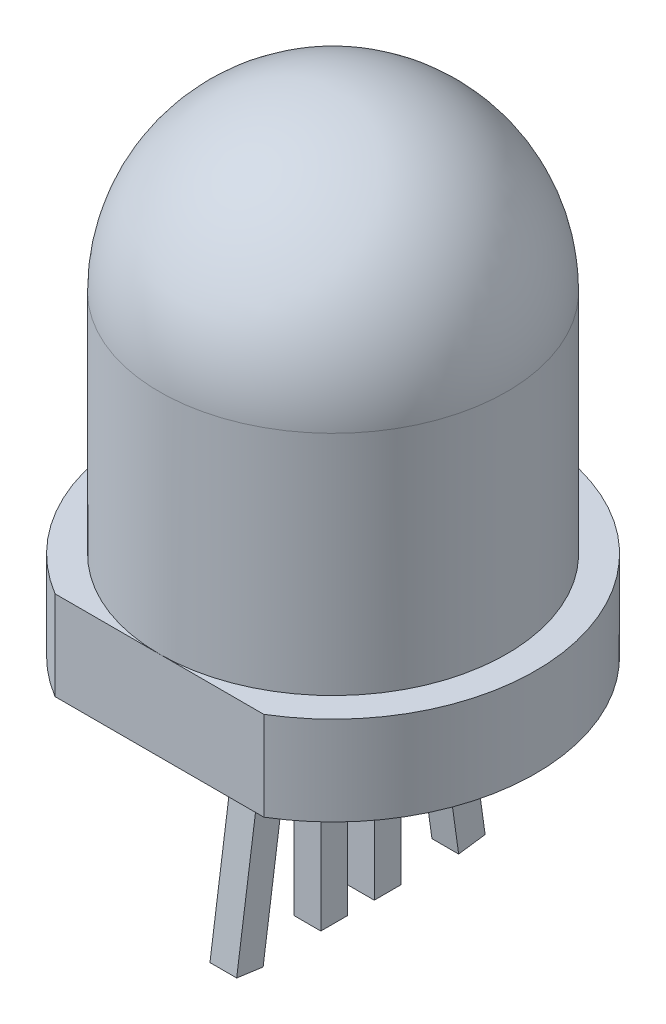
ISO-10303-21;
HEADER;
FILE_DESCRIPTION(('STEP AP214'),'2;1');
FILE_NAME('part.step','',(''),(''),'','','');
FILE_SCHEMA(('AUTOMOTIVE_DESIGN { 1 0 10303 214 1 1 1 1 }'));
ENDSEC;
DATA;
#1=APPLICATION_CONTEXT('core data for automotive mechanical design processes');
#2=APPLICATION_PROTOCOL_DEFINITION('international standard','automotive_design',2000,#1);
#3=PRODUCT_CONTEXT('',#1,'mechanical');
#4=PRODUCT('Part','Part','',(#3));
#5=PRODUCT_RELATED_PRODUCT_CATEGORY('part','',(#4));
#6=PRODUCT_DEFINITION_FORMATION('','',#4);
#7=PRODUCT_DEFINITION_CONTEXT('part definition',#1,'design');
#8=PRODUCT_DEFINITION('design','',#6,#7);
#9=PRODUCT_DEFINITION_SHAPE('','',#8);
#10=(LENGTH_UNIT() NAMED_UNIT(*) SI_UNIT(.MILLI.,.METRE.));
#11=(NAMED_UNIT(*) PLANE_ANGLE_UNIT() SI_UNIT($,.RADIAN.));
#12=(NAMED_UNIT(*) SI_UNIT($,.STERADIAN.) SOLID_ANGLE_UNIT());
#13=UNCERTAINTY_MEASURE_WITH_UNIT(LENGTH_MEASURE(1.E-05),#10,'distance_accuracy_value','');
#14=(GEOMETRIC_REPRESENTATION_CONTEXT(3) GLOBAL_UNCERTAINTY_ASSIGNED_CONTEXT((#13)) GLOBAL_UNIT_ASSIGNED_CONTEXT((#10,
#11,#12)) REPRESENTATION_CONTEXT('',''));
#15=CARTESIAN_POINT('',(0.,0.,0.));
#16=DIRECTION('',(0.,0.,1.));
#17=DIRECTION('',(1.,0.,0.));
#18=AXIS2_PLACEMENT_3D('',#15,#16,#17);
#19=CARTESIAN_POINT('',(0.,-2.,0.));
#20=DIRECTION('',(0.,-1.,0.));
#21=DIRECTION('',(0.,0.,-1.));
#22=AXIS2_PLACEMENT_3D('',#19,#20,#21);
#23=PLANE('',#22);
#24=CARTESIAN_POINT('',(0.,-2.,0.));
#25=DIRECTION('',(0.,-1.,0.));
#26=DIRECTION('',(0.,0.,-1.));
#27=AXIS2_PLACEMENT_3D('',#24,#25,#26);
#28=CIRCLE('',#27,4.55);
#29=CARTESIAN_POINT('',(-2.34360832905159,-2.,3.9));
#30=VERTEX_POINT('',#29);
#31=CARTESIAN_POINT('',(2.34360832905159,-2.,3.9));
#32=VERTEX_POINT('',#31);
#33=EDGE_CURVE('E266',#30,#32,#28,.T.);
#34=ORIENTED_EDGE('',*,*,#33,.T.);
#35=DIRECTION('',(-1.,0.,0.));
#36=VECTOR('',#35,1.);
#37=CARTESIAN_POINT('',(2.34360832905159,-2.,3.9));
#38=LINE('',#37,#36);
#39=EDGE_CURVE('E269',#32,#30,#38,.T.);
#40=ORIENTED_EDGE('',*,*,#39,.T.);
#41=EDGE_LOOP('',(#34,#40));
#42=FACE_BOUND('',#41,.T.);
#43=DIRECTION('',(1.,0.,0.));
#44=VECTOR('',#43,1.);
#45=CARTESIAN_POINT('',(-0.3,-2.,-0.0250000000000005));
#46=LINE('',#45,#44);
#47=CARTESIAN_POINT('',(-0.3,-2.,-0.0250000000000005));
#48=VERTEX_POINT('',#47);
#49=CARTESIAN_POINT('',(0.3,-2.,-0.0250000000000004));
#50=VERTEX_POINT('',#49);
#51=EDGE_CURVE('E250',#48,#50,#46,.T.);
#52=ORIENTED_EDGE('',*,*,#51,.F.);
#53=DIRECTION('',(0.,0.,-1.));
#54=VECTOR('',#53,1.);
#55=CARTESIAN_POINT('',(-0.3,-2.,-0.0250000000000005));
#56=LINE('',#55,#54);
#57=CARTESIAN_POINT('',(-0.3,-2.,0.574999999999999));
#58=VERTEX_POINT('',#57);
#59=EDGE_CURVE('E236',#58,#48,#56,.T.);
#60=ORIENTED_EDGE('',*,*,#59,.F.);
#61=DIRECTION('',(-1.,0.,0.));
#62=VECTOR('',#61,1.);
#63=CARTESIAN_POINT('',(-0.3,-2.,0.574999999999999));
#64=LINE('',#63,#62);
#65=CARTESIAN_POINT('',(0.3,-2.,0.575));
#66=VERTEX_POINT('',#65);
#67=EDGE_CURVE('E241',#66,#58,#64,.T.);
#68=ORIENTED_EDGE('',*,*,#67,.F.);
#69=DIRECTION('',(0.,0.,1.));
#70=VECTOR('',#69,1.);
#71=CARTESIAN_POINT('',(0.3,-2.,-0.0250000000000004));
#72=LINE('',#71,#70);
#73=EDGE_CURVE('E252',#50,#66,#72,.T.);
#74=ORIENTED_EDGE('',*,*,#73,.F.);
#75=EDGE_LOOP('',(#52,#60,#68,#74));
#76=FACE_BOUND('',#75,.T.);
#77=DIRECTION('',(-1.,0.,0.));
#78=VECTOR('',#77,1.);
#79=CARTESIAN_POINT('',(0.299999999999999,-2.,-0.625));
#80=LINE('',#79,#78);
#81=CARTESIAN_POINT('',(0.299999999999999,-2.,-0.625));
#82=VERTEX_POINT('',#81);
#83=CARTESIAN_POINT('',(-0.3,-2.,-0.625));
#84=VERTEX_POINT('',#83);
#85=EDGE_CURVE('E221',#82,#84,#80,.T.);
#86=ORIENTED_EDGE('',*,*,#85,.F.);
#87=DIRECTION('',(0.,0.,1.));
#88=VECTOR('',#87,1.);
#89=CARTESIAN_POINT('',(0.299999999999999,-2.,-1.225));
#90=LINE('',#89,#88);
#91=CARTESIAN_POINT('',(0.299999999999999,-2.,-1.225));
#92=VERTEX_POINT('',#91);
#93=EDGE_CURVE('E207',#92,#82,#90,.T.);
#94=ORIENTED_EDGE('',*,*,#93,.F.);
#95=DIRECTION('',(1.,0.,0.));
#96=VECTOR('',#95,1.);
#97=CARTESIAN_POINT('',(0.299999999999999,-2.,-1.225));
#98=LINE('',#97,#96);
#99=CARTESIAN_POINT('',(-0.3,-2.,-1.225));
#100=VERTEX_POINT('',#99);
#101=EDGE_CURVE('E212',#100,#92,#98,.T.);
#102=ORIENTED_EDGE('',*,*,#101,.F.);
#103=DIRECTION('',(0.,0.,-1.));
#104=VECTOR('',#103,1.);
#105=CARTESIAN_POINT('',(-0.3,-2.,-1.225));
#106=LINE('',#105,#104);
#107=EDGE_CURVE('E223',#84,#100,#106,.T.);
#108=ORIENTED_EDGE('',*,*,#107,.F.);
#109=EDGE_LOOP('',(#86,#94,#102,#108));
#110=FACE_BOUND('',#109,.T.);
#111=DIRECTION('',(1.,0.,0.));
#112=VECTOR('',#111,1.);
#113=CARTESIAN_POINT('',(0.,-2.,1.78089654351117));
#114=LINE('',#113,#112);
#115=CARTESIAN_POINT('',(-0.3,-2.,1.78089654351117));
#116=VERTEX_POINT('',#115);
#117=CARTESIAN_POINT('',(0.3,-2.,1.78089654351117));
#118=VERTEX_POINT('',#117);
#119=EDGE_CURVE('E291',#116,#118,#114,.T.);
#120=ORIENTED_EDGE('',*,*,#119,.T.);
#121=DIRECTION('',(0.,0.,-1.));
#122=VECTOR('',#121,1.);
#123=CARTESIAN_POINT('',(0.3,-2.,0.));
#124=LINE('',#123,#122);
#125=CARTESIAN_POINT('',(0.3,-2.,1.175));
#126=VERTEX_POINT('',#125);
#127=EDGE_CURVE('E294',#118,#126,#124,.T.);
#128=ORIENTED_EDGE('',*,*,#127,.T.);
#129=DIRECTION('',(1.,0.,0.));
#130=VECTOR('',#129,1.);
#131=CARTESIAN_POINT('',(0.3,-2.,1.175));
#132=LINE('',#131,#130);
#133=CARTESIAN_POINT('',(-0.3,-2.,1.175));
#134=VERTEX_POINT('',#133);
#135=EDGE_CURVE('E180',#134,#126,#132,.T.);
#136=ORIENTED_EDGE('',*,*,#135,.F.);
#137=DIRECTION('',(0.,0.,1.));
#138=VECTOR('',#137,1.);
#139=CARTESIAN_POINT('',(-0.300000000000001,-2.,0.));
#140=LINE('',#139,#138);
#141=EDGE_CURVE('E288',#134,#116,#140,.T.);
#142=ORIENTED_EDGE('',*,*,#141,.T.);
#143=EDGE_LOOP('',(#120,#128,#136,#142));
#144=FACE_BOUND('',#143,.T.);
#145=DIRECTION('',(-1.,0.,0.));
#146=VECTOR('',#145,1.);
#147=CARTESIAN_POINT('',(0.299999999999999,-2.,-1.825));
#148=LINE('',#147,#146);
#149=CARTESIAN_POINT('',(0.299999999999999,-2.,-1.82500000000001));
#150=VERTEX_POINT('',#149);
#151=CARTESIAN_POINT('',(-0.300000000000001,-2.,-1.825));
#152=VERTEX_POINT('',#151);
#153=EDGE_CURVE('E177',#150,#152,#148,.T.);
#154=ORIENTED_EDGE('',*,*,#153,.F.);
#155=DIRECTION('',(0.,0.,-1.));
#156=VECTOR('',#155,1.);
#157=CARTESIAN_POINT('',(0.299999999999999,-2.,0.));
#158=LINE('',#157,#156);
#159=CARTESIAN_POINT('',(0.299999999999999,-2.,-2.43089654351117));
#160=VERTEX_POINT('',#159);
#161=EDGE_CURVE('E11',#150,#160,#158,.T.);
#162=ORIENTED_EDGE('',*,*,#161,.T.);
#163=DIRECTION('',(-1.,0.,0.));
#164=VECTOR('',#163,1.);
#165=CARTESIAN_POINT('',(0.,-2.,-2.43089654351117));
#166=LINE('',#165,#164);
#167=CARTESIAN_POINT('',(-0.3,-2.,-2.43089654351117));
#168=VERTEX_POINT('',#167);
#169=EDGE_CURVE('E42',#160,#168,#166,.T.);
#170=ORIENTED_EDGE('',*,*,#169,.T.);
#171=DIRECTION('',(0.,0.,1.));
#172=VECTOR('',#171,1.);
#173=CARTESIAN_POINT('',(-0.300000000000001,-2.,0.));
#174=LINE('',#173,#172);
#175=EDGE_CURVE('E297',#168,#152,#174,.T.);
#176=ORIENTED_EDGE('',*,*,#175,.T.);
#177=EDGE_LOOP('',(#154,#162,#170,#176));
#178=FACE_BOUND('',#177,.T.);
#179=ADVANCED_FACE('F34',(#42,#76,#110,#144,#178),#23,.T.);
#180=CARTESIAN_POINT('',(0.,9.,0.));
#181=DIRECTION('',(0.,-1.,0.));
#182=DIRECTION('',(0.,0.,-1.));
#183=AXIS2_PLACEMENT_3D('',#180,#181,#182);
#184=CYLINDRICAL_SURFACE('',#183,3.9);
#185=CARTESIAN_POINT('',(0.,5.1,0.));
#186=DIRECTION('',(0.,-1.,0.));
#187=DIRECTION('',(0.,0.,-1.));
#188=AXIS2_PLACEMENT_3D('',#185,#186,#187);
#189=CIRCLE('',#188,3.9);
#190=CARTESIAN_POINT('',(0.,5.1,-3.9));
#191=VERTEX_POINT('',#190);
#192=EDGE_CURVE('E285',#191,#191,#189,.T.);
#193=ORIENTED_EDGE('',*,*,#192,.T.);
#194=EDGE_LOOP('',(#193));
#195=FACE_BOUND('',#194,.T.);
#196=CARTESIAN_POINT('',(0.,0.,0.));
#197=DIRECTION('',(0.,1.,0.));
#198=DIRECTION('',(0.,0.,1.));
#199=AXIS2_PLACEMENT_3D('',#196,#197,#198);
#200=CIRCLE('',#199,3.9);
#201=CARTESIAN_POINT('',(0.,0.,3.9));
#202=VERTEX_POINT('',#201);
#203=EDGE_CURVE('E282',#202,#202,#200,.T.);
#204=ORIENTED_EDGE('',*,*,#203,.T.);
#205=EDGE_LOOP('',(#204));
#206=FACE_BOUND('',#205,.T.);
#207=ADVANCED_FACE('F318',(#195,#206),#184,.T.);
#208=CARTESIAN_POINT('',(0.,5.1,0.));
#209=DIRECTION('',(0.,0.,1.));
#210=DIRECTION('',(1.,0.,0.));
#211=AXIS2_PLACEMENT_3D('',#208,#209,#210);
#212=SPHERICAL_SURFACE('',#211,3.9);
#213=CARTESIAN_POINT('',(0.,5.1,0.));
#214=DIRECTION('',(0.,-1.,0.));
#215=DIRECTION('',(0.,0.,-1.));
#216=AXIS2_PLACEMENT_3D('',#213,#214,#215);
#217=SPHERICAL_SURFACE('',#216,3.9);
#218=ORIENTED_EDGE('',*,*,#192,.F.);
#219=EDGE_LOOP('',(#218));
#220=FACE_BOUND('',#219,.T.);
#221=ADVANCED_FACE('F36',(#220),#217,.T.);
#222=CARTESIAN_POINT('',(0.,-2.,0.));
#223=DIRECTION('',(0.,1.,0.));
#224=DIRECTION('',(0.,0.,1.));
#225=AXIS2_PLACEMENT_3D('',#222,#223,#224);
#226=CYLINDRICAL_SURFACE('',#225,4.55);
#227=CARTESIAN_POINT('',(0.,0.,0.));
#228=DIRECTION('',(0.,-1.,0.));
#229=DIRECTION('',(0.,0.,-1.));
#230=AXIS2_PLACEMENT_3D('',#227,#228,#229);
#231=CIRCLE('',#230,4.55);
#232=CARTESIAN_POINT('',(-2.34360832905159,0.,3.9));
#233=VERTEX_POINT('',#232);
#234=CARTESIAN_POINT('',(2.34360832905159,0.,3.9));
#235=VERTEX_POINT('',#234);
#236=EDGE_CURVE('E265',#233,#235,#231,.T.);
#237=ORIENTED_EDGE('',*,*,#236,.T.);
#238=DIRECTION('',(0.,1.,0.));
#239=VECTOR('',#238,1.);
#240=CARTESIAN_POINT('',(2.34360832905159,-2.,3.9));
#241=LINE('',#240,#239);
#242=EDGE_CURVE('E279',#32,#235,#241,.T.);
#243=ORIENTED_EDGE('',*,*,#242,.F.);
#244=ORIENTED_EDGE('',*,*,#33,.F.);
#245=DIRECTION('',(0.,1.,0.));
#246=VECTOR('',#245,1.);
#247=CARTESIAN_POINT('',(-2.34360832905159,-2.,3.9));
#248=LINE('',#247,#246);
#249=EDGE_CURVE('E272',#30,#233,#248,.T.);
#250=ORIENTED_EDGE('',*,*,#249,.T.);
#251=EDGE_LOOP('',(#237,#243,#244,#250));
#252=FACE_BOUND('',#251,.T.);
#253=ADVANCED_FACE('F337',(#252),#226,.T.);
#254=CARTESIAN_POINT('',(2.34360832905159,-2.,3.9));
#255=DIRECTION('',(0.,0.,-1.));
#256=DIRECTION('',(-1.,0.,0.));
#257=AXIS2_PLACEMENT_3D('',#254,#255,#256);
#258=PLANE('',#257);
#259=DIRECTION('',(-1.,0.,0.));
#260=VECTOR('',#259,1.);
#261=CARTESIAN_POINT('',(2.34360832905159,0.,3.9));
#262=LINE('',#261,#260);
#263=EDGE_CURVE('E270',#235,#202,#262,.T.);
#264=ORIENTED_EDGE('',*,*,#263,.T.);
#265=EDGE_CURVE('E275',#202,#233,#262,.T.);
#266=ORIENTED_EDGE('',*,*,#265,.T.);
#267=ORIENTED_EDGE('',*,*,#249,.F.);
#268=ORIENTED_EDGE('',*,*,#39,.F.);
#269=ORIENTED_EDGE('',*,*,#242,.T.);
#270=EDGE_LOOP('',(#264,#266,#267,#268,#269));
#271=FACE_BOUND('',#270,.T.);
#272=ADVANCED_FACE('F333',(#271),#258,.F.);
#273=CARTESIAN_POINT('',(0.,0.,0.));
#274=DIRECTION('',(0.,-1.,0.));
#275=DIRECTION('',(0.,0.,-1.));
#276=AXIS2_PLACEMENT_3D('',#273,#274,#275);
#277=PLANE('',#276);
#278=ORIENTED_EDGE('',*,*,#265,.F.);
#279=ORIENTED_EDGE('',*,*,#203,.F.);
#280=ORIENTED_EDGE('',*,*,#263,.F.);
#281=ORIENTED_EDGE('',*,*,#236,.F.);
#282=EDGE_LOOP('',(#278,#279,#280,#281));
#283=FACE_BOUND('',#282,.T.);
#284=ADVANCED_FACE('F330',(#283),#277,.F.);
#285=CARTESIAN_POINT('',(-0.3,-6.9,-0.0250000000000005));
#286=DIRECTION('',(1.,0.,0.));
#287=DIRECTION('',(0.,0.,-1.));
#288=AXIS2_PLACEMENT_3D('',#285,#286,#287);
#289=PLANE('',#288);
#290=ORIENTED_EDGE('',*,*,#59,.T.);
#291=DIRECTION('',(0.,1.,0.));
#292=VECTOR('',#291,1.);
#293=CARTESIAN_POINT('',(-0.3,-6.9,-0.0250000000000005));
#294=LINE('',#293,#292);
#295=CARTESIAN_POINT('',(-0.3,-6.9,-0.0250000000000005));
#296=VERTEX_POINT('',#295);
#297=EDGE_CURVE('E263',#296,#48,#294,.T.);
#298=ORIENTED_EDGE('',*,*,#297,.F.);
#299=DIRECTION('',(0.,0.,-1.));
#300=VECTOR('',#299,1.);
#301=CARTESIAN_POINT('',(-0.3,-6.9,-0.0250000000000005));
#302=LINE('',#301,#300);
#303=CARTESIAN_POINT('',(-0.3,-6.9,0.574999999999999));
#304=VERTEX_POINT('',#303);
#305=EDGE_CURVE('E237',#304,#296,#302,.T.);
#306=ORIENTED_EDGE('',*,*,#305,.F.);
#307=DIRECTION('',(0.,1.,0.));
#308=VECTOR('',#307,1.);
#309=CARTESIAN_POINT('',(-0.3,-6.9,0.574999999999999));
#310=LINE('',#309,#308);
#311=EDGE_CURVE('E247',#304,#58,#310,.T.);
#312=ORIENTED_EDGE('',*,*,#311,.T.);
#313=EDGE_LOOP('',(#290,#298,#306,#312));
#314=FACE_BOUND('',#313,.T.);
#315=ADVANCED_FACE('F328',(#314),#289,.F.);
#316=CARTESIAN_POINT('',(-0.3,-6.9,-0.0250000000000005));
#317=DIRECTION('',(0.,0.,1.));
#318=DIRECTION('',(1.,0.,0.));
#319=AXIS2_PLACEMENT_3D('',#316,#317,#318);
#320=PLANE('',#319);
#321=ORIENTED_EDGE('',*,*,#51,.T.);
#322=DIRECTION('',(0.,1.,0.));
#323=VECTOR('',#322,1.);
#324=CARTESIAN_POINT('',(0.3,-6.9,-0.0250000000000004));
#325=LINE('',#324,#323);
#326=CARTESIAN_POINT('',(0.3,-6.9,-0.0250000000000004));
#327=VERTEX_POINT('',#326);
#328=EDGE_CURVE('E260',#327,#50,#325,.T.);
#329=ORIENTED_EDGE('',*,*,#328,.F.);
#330=DIRECTION('',(1.,0.,0.));
#331=VECTOR('',#330,1.);
#332=CARTESIAN_POINT('',(-0.3,-6.9,-0.0250000000000005));
#333=LINE('',#332,#331);
#334=EDGE_CURVE('E240',#296,#327,#333,.T.);
#335=ORIENTED_EDGE('',*,*,#334,.F.);
#336=ORIENTED_EDGE('',*,*,#297,.T.);
#337=EDGE_LOOP('',(#321,#329,#335,#336));
#338=FACE_BOUND('',#337,.T.);
#339=ADVANCED_FACE('F392',(#338),#320,.F.);
#340=CARTESIAN_POINT('',(0.3,-6.9,-0.0250000000000004));
#341=DIRECTION('',(-1.,0.,0.));
#342=DIRECTION('',(0.,0.,1.));
#343=AXIS2_PLACEMENT_3D('',#340,#341,#342);
#344=PLANE('',#343);
#345=ORIENTED_EDGE('',*,*,#73,.T.);
#346=DIRECTION('',(0.,1.,0.));
#347=VECTOR('',#346,1.);
#348=CARTESIAN_POINT('',(0.3,-6.9,0.575));
#349=LINE('',#348,#347);
#350=CARTESIAN_POINT('',(0.3,-6.9,0.575));
#351=VERTEX_POINT('',#350);
#352=EDGE_CURVE('E258',#351,#66,#349,.T.);
#353=ORIENTED_EDGE('',*,*,#352,.F.);
#354=DIRECTION('',(0.,0.,1.));
#355=VECTOR('',#354,1.);
#356=CARTESIAN_POINT('',(0.3,-6.9,-0.0250000000000004));
#357=LINE('',#356,#355);
#358=EDGE_CURVE('E243',#327,#351,#357,.T.);
#359=ORIENTED_EDGE('',*,*,#358,.F.);
#360=ORIENTED_EDGE('',*,*,#328,.T.);
#361=EDGE_LOOP('',(#345,#353,#359,#360));
#362=FACE_BOUND('',#361,.T.);
#363=ADVANCED_FACE('F401',(#362),#344,.F.);
#364=CARTESIAN_POINT('',(-0.3,-6.9,0.574999999999999));
#365=DIRECTION('',(0.,0.,-1.));
#366=DIRECTION('',(-1.,0.,0.));
#367=AXIS2_PLACEMENT_3D('',#364,#365,#366);
#368=PLANE('',#367);
#369=ORIENTED_EDGE('',*,*,#67,.T.);
#370=ORIENTED_EDGE('',*,*,#311,.F.);
#371=DIRECTION('',(-1.,0.,0.));
#372=VECTOR('',#371,1.);
#373=CARTESIAN_POINT('',(-0.3,-6.9,0.574999999999999));
#374=LINE('',#373,#372);
#375=EDGE_CURVE('E245',#351,#304,#374,.T.);
#376=ORIENTED_EDGE('',*,*,#375,.F.);
#377=ORIENTED_EDGE('',*,*,#352,.T.);
#378=EDGE_LOOP('',(#369,#370,#376,#377));
#379=FACE_BOUND('',#378,.T.);
#380=ADVANCED_FACE('F410',(#379),#368,.F.);
#381=CARTESIAN_POINT('',(0.,-6.9,0.));
#382=DIRECTION('',(0.,1.,0.));
#383=DIRECTION('',(0.,0.,1.));
#384=AXIS2_PLACEMENT_3D('',#381,#382,#383);
#385=PLANE('',#384);
#386=ORIENTED_EDGE('',*,*,#305,.T.);
#387=ORIENTED_EDGE('',*,*,#334,.T.);
#388=ORIENTED_EDGE('',*,*,#358,.T.);
#389=ORIENTED_EDGE('',*,*,#375,.T.);
#390=EDGE_LOOP('',(#386,#387,#388,#389));
#391=FACE_BOUND('',#390,.T.);
#392=ADVANCED_FACE('F420',(#391),#385,.F.);
#393=CARTESIAN_POINT('',(0.299999999999999,-6.9,-1.225));
#394=DIRECTION('',(-1.,0.,0.));
#395=DIRECTION('',(0.,0.,1.));
#396=AXIS2_PLACEMENT_3D('',#393,#394,#395);
#397=PLANE('',#396);
#398=ORIENTED_EDGE('',*,*,#93,.T.);
#399=DIRECTION('',(0.,1.,0.));
#400=VECTOR('',#399,1.);
#401=CARTESIAN_POINT('',(0.299999999999999,-6.9,-0.625));
#402=LINE('',#401,#400);
#403=CARTESIAN_POINT('',(0.299999999999999,-6.9,-0.625));
#404=VERTEX_POINT('',#403);
#405=EDGE_CURVE('E234',#404,#82,#402,.T.);
#406=ORIENTED_EDGE('',*,*,#405,.F.);
#407=DIRECTION('',(0.,0.,1.));
#408=VECTOR('',#407,1.);
#409=CARTESIAN_POINT('',(0.299999999999999,-6.9,-1.225));
#410=LINE('',#409,#408);
#411=CARTESIAN_POINT('',(0.299999999999999,-6.9,-1.225));
#412=VERTEX_POINT('',#411);
#413=EDGE_CURVE('E208',#412,#404,#410,.T.);
#414=ORIENTED_EDGE('',*,*,#413,.F.);
#415=DIRECTION('',(0.,1.,0.));
#416=VECTOR('',#415,1.);
#417=CARTESIAN_POINT('',(0.299999999999999,-6.9,-1.225));
#418=LINE('',#417,#416);
#419=EDGE_CURVE('E218',#412,#92,#418,.T.);
#420=ORIENTED_EDGE('',*,*,#419,.T.);
#421=EDGE_LOOP('',(#398,#406,#414,#420));
#422=FACE_BOUND('',#421,.T.);
#423=ADVANCED_FACE('F430',(#422),#397,.F.);
#424=CARTESIAN_POINT('',(0.299999999999999,-6.9,-0.625));
#425=DIRECTION('',(0.,0.,-1.));
#426=DIRECTION('',(-1.,0.,0.));
#427=AXIS2_PLACEMENT_3D('',#424,#425,#426);
#428=PLANE('',#427);
#429=ORIENTED_EDGE('',*,*,#85,.T.);
#430=DIRECTION('',(0.,1.,0.));
#431=VECTOR('',#430,1.);
#432=CARTESIAN_POINT('',(-0.3,-6.9,-0.625));
#433=LINE('',#432,#431);
#434=CARTESIAN_POINT('',(-0.3,-6.9,-0.625));
#435=VERTEX_POINT('',#434);
#436=EDGE_CURVE('E231',#435,#84,#433,.T.);
#437=ORIENTED_EDGE('',*,*,#436,.F.);
#438=DIRECTION('',(-1.,0.,0.));
#439=VECTOR('',#438,1.);
#440=CARTESIAN_POINT('',(0.299999999999999,-6.9,-0.625));
#441=LINE('',#440,#439);
#442=EDGE_CURVE('E211',#404,#435,#441,.T.);
#443=ORIENTED_EDGE('',*,*,#442,.F.);
#444=ORIENTED_EDGE('',*,*,#405,.T.);
#445=EDGE_LOOP('',(#429,#437,#443,#444));
#446=FACE_BOUND('',#445,.T.);
#447=ADVANCED_FACE('F440',(#446),#428,.F.);
#448=CARTESIAN_POINT('',(-0.3,-6.9,-1.225));
#449=DIRECTION('',(1.,0.,0.));
#450=DIRECTION('',(0.,0.,-1.));
#451=AXIS2_PLACEMENT_3D('',#448,#449,#450);
#452=PLANE('',#451);
#453=ORIENTED_EDGE('',*,*,#107,.T.);
#454=DIRECTION('',(0.,1.,0.));
#455=VECTOR('',#454,1.);
#456=CARTESIAN_POINT('',(-0.3,-6.9,-1.225));
#457=LINE('',#456,#455);
#458=CARTESIAN_POINT('',(-0.3,-6.9,-1.225));
#459=VERTEX_POINT('',#458);
#460=EDGE_CURVE('E229',#459,#100,#457,.T.);
#461=ORIENTED_EDGE('',*,*,#460,.F.);
#462=DIRECTION('',(0.,0.,-1.));
#463=VECTOR('',#462,1.);
#464=CARTESIAN_POINT('',(-0.3,-6.9,-1.225));
#465=LINE('',#464,#463);
#466=EDGE_CURVE('E214',#435,#459,#465,.T.);
#467=ORIENTED_EDGE('',*,*,#466,.F.);
#468=ORIENTED_EDGE('',*,*,#436,.T.);
#469=EDGE_LOOP('',(#453,#461,#467,#468));
#470=FACE_BOUND('',#469,.T.);
#471=ADVANCED_FACE('F450',(#470),#452,.F.);
#472=CARTESIAN_POINT('',(0.299999999999999,-6.9,-1.225));
#473=DIRECTION('',(0.,0.,1.));
#474=DIRECTION('',(1.,0.,0.));
#475=AXIS2_PLACEMENT_3D('',#472,#473,#474);
#476=PLANE('',#475);
#477=ORIENTED_EDGE('',*,*,#101,.T.);
#478=ORIENTED_EDGE('',*,*,#419,.F.);
#479=DIRECTION('',(1.,0.,0.));
#480=VECTOR('',#479,1.);
#481=CARTESIAN_POINT('',(0.299999999999999,-6.9,-1.225));
#482=LINE('',#481,#480);
#483=EDGE_CURVE('E216',#459,#412,#482,.T.);
#484=ORIENTED_EDGE('',*,*,#483,.F.);
#485=ORIENTED_EDGE('',*,*,#460,.T.);
#486=EDGE_LOOP('',(#477,#478,#484,#485));
#487=FACE_BOUND('',#486,.T.);
#488=ADVANCED_FACE('F460',(#487),#476,.F.);
#489=CARTESIAN_POINT('',(0.,-6.9,0.));
#490=DIRECTION('',(0.,-1.,0.));
#491=DIRECTION('',(0.,0.,-1.));
#492=AXIS2_PLACEMENT_3D('',#489,#490,#491);
#493=PLANE('',#492);
#494=ORIENTED_EDGE('',*,*,#413,.T.);
#495=ORIENTED_EDGE('',*,*,#442,.T.);
#496=ORIENTED_EDGE('',*,*,#466,.T.);
#497=ORIENTED_EDGE('',*,*,#483,.T.);
#498=EDGE_LOOP('',(#494,#495,#496,#497));
#499=FACE_BOUND('',#498,.T.);
#500=ADVANCED_FACE('F470',(#499),#493,.T.);
#501=CARTESIAN_POINT('',(0.3,-6.95134034370785,1.87086550480033));
#502=DIRECTION('',(-1.,0.,0.));
#503=DIRECTION('',(0.,0.,1.));
#504=AXIS2_PLACEMENT_3D('',#501,#502,#503);
#505=PLANE('',#504);
#506=ORIENTED_EDGE('',*,*,#127,.F.);
#507=DIRECTION('',(0.,0.99026806874157,-0.139173100960066));
#508=VECTOR('',#507,1.);
#509=CARTESIAN_POINT('',(0.3,-6.86783648313181,2.46502634604527));
#510=LINE('',#509,#508);
#511=CARTESIAN_POINT('',(0.3,-6.86783648313181,2.46502634604527));
#512=VERTEX_POINT('',#511);
#513=EDGE_CURVE('E204',#512,#118,#510,.T.);
#514=ORIENTED_EDGE('',*,*,#513,.F.);
#515=DIRECTION('',(0.,0.139173100960065,0.99026806874157));
#516=VECTOR('',#515,1.);
#517=CARTESIAN_POINT('',(0.3,-6.95134034370785,1.87086550480033));
#518=LINE('',#517,#516);
#519=CARTESIAN_POINT('',(0.3,-6.95134034370785,1.87086550480033));
#520=VERTEX_POINT('',#519);
#521=EDGE_CURVE('E182',#520,#512,#518,.T.);
#522=ORIENTED_EDGE('',*,*,#521,.F.);
#523=DIRECTION('',(0.,0.99026806874157,-0.139173100960066));
#524=VECTOR('',#523,1.);
#525=CARTESIAN_POINT('',(0.3,-6.95134034370785,1.87086550480033));
#526=LINE('',#525,#524);
#527=EDGE_CURVE('E195',#520,#126,#526,.T.);
#528=ORIENTED_EDGE('',*,*,#527,.T.);
#529=EDGE_LOOP('',(#506,#514,#522,#528));
#530=FACE_BOUND('',#529,.T.);
#531=ADVANCED_FACE('F480',(#530),#505,.F.);
#532=CARTESIAN_POINT('',(0.3,-6.86783648313181,2.46502634604527));
#533=DIRECTION('',(0.,-0.139173100960066,-0.99026806874157));
#534=DIRECTION('',(0.,0.99026806874157,-0.139173100960066));
#535=AXIS2_PLACEMENT_3D('',#532,#533,#534);
#536=PLANE('',#535);
#537=ORIENTED_EDGE('',*,*,#119,.F.);
#538=DIRECTION('',(0.,0.99026806874157,-0.139173100960066));
#539=VECTOR('',#538,1.);
#540=CARTESIAN_POINT('',(-0.3,-6.86783648313181,2.46502634604527));
#541=LINE('',#540,#539);
#542=CARTESIAN_POINT('',(-0.3,-6.86783648313181,2.46502634604527));
#543=VERTEX_POINT('',#542);
#544=EDGE_CURVE('E201',#543,#116,#541,.T.);
#545=ORIENTED_EDGE('',*,*,#544,.F.);
#546=DIRECTION('',(-1.,0.,0.));
#547=VECTOR('',#546,1.);
#548=CARTESIAN_POINT('',(0.3,-6.86783648313181,2.46502634604527));
#549=LINE('',#548,#547);
#550=EDGE_CURVE('E190',#512,#543,#549,.T.);
#551=ORIENTED_EDGE('',*,*,#550,.F.);
#552=ORIENTED_EDGE('',*,*,#513,.T.);
#553=EDGE_LOOP('',(#537,#545,#551,#552));
#554=FACE_BOUND('',#553,.T.);
#555=ADVANCED_FACE('F490',(#554),#536,.F.);
#556=CARTESIAN_POINT('',(-0.3,-6.95134034370785,1.87086550480033));
#557=DIRECTION('',(1.,0.,0.));
#558=DIRECTION('',(0.,0.,-1.));
#559=AXIS2_PLACEMENT_3D('',#556,#557,#558);
#560=PLANE('',#559);
#561=ORIENTED_EDGE('',*,*,#141,.F.);
#562=DIRECTION('',(0.,0.99026806874157,-0.139173100960066));
#563=VECTOR('',#562,1.);
#564=CARTESIAN_POINT('',(-0.3,-6.95134034370785,1.87086550480033));
#565=LINE('',#564,#563);
#566=CARTESIAN_POINT('',(-0.3,-6.95134034370785,1.87086550480033));
#567=VERTEX_POINT('',#566);
#568=EDGE_CURVE('E199',#567,#134,#565,.T.);
#569=ORIENTED_EDGE('',*,*,#568,.F.);
#570=DIRECTION('',(0.,-0.139173100960065,-0.99026806874157));
#571=VECTOR('',#570,1.);
#572=CARTESIAN_POINT('',(-0.3,-6.95134034370785,1.87086550480033));
#573=LINE('',#572,#571);
#574=EDGE_CURVE('E192',#543,#567,#573,.T.);
#575=ORIENTED_EDGE('',*,*,#574,.F.);
#576=ORIENTED_EDGE('',*,*,#544,.T.);
#577=EDGE_LOOP('',(#561,#569,#575,#576));
#578=FACE_BOUND('',#577,.T.);
#579=ADVANCED_FACE('F500',(#578),#560,.F.);
#580=CARTESIAN_POINT('',(0.3,-6.95134034370785,1.87086550480033));
#581=DIRECTION('',(0.,0.139173100960066,0.99026806874157));
#582=DIRECTION('',(0.,-0.99026806874157,0.139173100960066));
#583=AXIS2_PLACEMENT_3D('',#580,#581,#582);
#584=PLANE('',#583);
#585=ORIENTED_EDGE('',*,*,#135,.T.);
#586=ORIENTED_EDGE('',*,*,#527,.F.);
#587=DIRECTION('',(1.,0.,0.));
#588=VECTOR('',#587,1.);
#589=CARTESIAN_POINT('',(0.3,-6.95134034370785,1.87086550480033));
#590=LINE('',#589,#588);
#591=EDGE_CURVE('E194',#567,#520,#590,.T.);
#592=ORIENTED_EDGE('',*,*,#591,.F.);
#593=ORIENTED_EDGE('',*,*,#568,.T.);
#594=EDGE_LOOP('',(#585,#586,#592,#593));
#595=FACE_BOUND('',#594,.T.);
#596=ADVANCED_FACE('F510',(#595),#584,.F.);
#597=CARTESIAN_POINT('',(0.,-7.07453898618866,0.994261614253566));
#598=DIRECTION('',(0.,-0.99026806874157,0.139173100960065));
#599=DIRECTION('',(0.,-0.139173100960065,-0.99026806874157));
#600=AXIS2_PLACEMENT_3D('',#597,#598,#599);
#601=PLANE('',#600);
#602=ORIENTED_EDGE('',*,*,#521,.T.);
#603=ORIENTED_EDGE('',*,*,#550,.T.);
#604=ORIENTED_EDGE('',*,*,#574,.T.);
#605=ORIENTED_EDGE('',*,*,#591,.T.);
#606=EDGE_LOOP('',(#602,#603,#604,#605));
#607=FACE_BOUND('',#606,.T.);
#608=ADVANCED_FACE('F520',(#607),#601,.T.);
#609=CARTESIAN_POINT('',(0.299999999999999,-6.95134034370785,-2.52086550480033));
#610=DIRECTION('',(-1.,0.,0.));
#611=DIRECTION('',(0.,0.,1.));
#612=AXIS2_PLACEMENT_3D('',#609,#610,#611);
#613=PLANE('',#612);
#614=ORIENTED_EDGE('',*,*,#161,.F.);
#615=DIRECTION('',(0.,0.99026806874157,0.139173100960066));
#616=VECTOR('',#615,1.);
#617=CARTESIAN_POINT('',(0.299999999999999,-6.95134034370785,-2.52086550480033));
#618=LINE('',#617,#616);
#619=CARTESIAN_POINT('',(0.299999999999999,-6.95134034370785,-2.52086550480033));
#620=VERTEX_POINT('',#619);
#621=EDGE_CURVE('E162',#620,#150,#618,.T.);
#622=ORIENTED_EDGE('',*,*,#621,.F.);
#623=DIRECTION('',(0.,-0.139173100960066,0.99026806874157));
#624=VECTOR('',#623,1.);
#625=CARTESIAN_POINT('',(0.299999999999999,-6.95134034370785,-2.52086550480033));
#626=LINE('',#625,#624);
#627=CARTESIAN_POINT('',(0.299999999999999,-6.86783648313181,-3.11502634604527));
#628=VERTEX_POINT('',#627);
#629=EDGE_CURVE('E168',#628,#620,#626,.T.);
#630=ORIENTED_EDGE('',*,*,#629,.F.);
#631=DIRECTION('',(0.,0.99026806874157,0.139173100960066));
#632=VECTOR('',#631,1.);
#633=CARTESIAN_POINT('',(0.299999999999999,-6.86783648313181,-3.11502634604527));
#634=LINE('',#633,#632);
#635=EDGE_CURVE('E304',#628,#160,#634,.T.);
#636=ORIENTED_EDGE('',*,*,#635,.T.);
#637=EDGE_LOOP('',(#614,#622,#630,#636));
#638=FACE_BOUND('',#637,.T.);
#639=ADVANCED_FACE('F179',(#638),#613,.F.);
#640=CARTESIAN_POINT('',(0.299999999999999,-6.95134034370785,-2.52086550480033));
#641=DIRECTION('',(0.,0.139173100960066,-0.99026806874157));
#642=DIRECTION('',(0.,0.99026806874157,0.139173100960066));
#643=AXIS2_PLACEMENT_3D('',#640,#641,#642);
#644=PLANE('',#643);
#645=ORIENTED_EDGE('',*,*,#153,.T.);
#646=DIRECTION('',(0.,0.99026806874157,0.139173100960066));
#647=VECTOR('',#646,1.);
#648=CARTESIAN_POINT('',(-0.300000000000001,-6.95134034370785,-2.52086550480033));
#649=LINE('',#648,#647);
#650=CARTESIAN_POINT('',(-0.300000000000001,-6.95134034370785,-2.52086550480033));
#651=VERTEX_POINT('',#650);
#652=EDGE_CURVE('E164',#651,#152,#649,.T.);
#653=ORIENTED_EDGE('',*,*,#652,.F.);
#654=DIRECTION('',(-1.,0.,0.));
#655=VECTOR('',#654,1.);
#656=CARTESIAN_POINT('',(0.299999999999999,-6.95134034370785,-2.52086550480033));
#657=LINE('',#656,#655);
#658=EDGE_CURVE('E157',#620,#651,#657,.T.);
#659=ORIENTED_EDGE('',*,*,#658,.F.);
#660=ORIENTED_EDGE('',*,*,#621,.T.);
#661=EDGE_LOOP('',(#645,#653,#659,#660));
#662=FACE_BOUND('',#661,.T.);
#663=ADVANCED_FACE('F160',(#662),#644,.F.);
#664=CARTESIAN_POINT('',(-0.300000000000001,-6.95134034370785,-2.52086550480033));
#665=DIRECTION('',(1.,0.,0.));
#666=DIRECTION('',(0.,0.,-1.));
#667=AXIS2_PLACEMENT_3D('',#664,#665,#666);
#668=PLANE('',#667);
#669=ORIENTED_EDGE('',*,*,#175,.F.);
#670=DIRECTION('',(0.,0.99026806874157,0.139173100960066));
#671=VECTOR('',#670,1.);
#672=CARTESIAN_POINT('',(-0.3,-6.86783648313181,-3.11502634604527));
#673=LINE('',#672,#671);
#674=CARTESIAN_POINT('',(-0.3,-6.86783648313181,-3.11502634604527));
#675=VERTEX_POINT('',#674);
#676=EDGE_CURVE('E184',#675,#168,#673,.T.);
#677=ORIENTED_EDGE('',*,*,#676,.F.);
#678=DIRECTION('',(0.,0.139173100960066,-0.99026806874157));
#679=VECTOR('',#678,1.);
#680=CARTESIAN_POINT('',(-0.300000000000001,-6.95134034370785,-2.52086550480033));
#681=LINE('',#680,#679);
#682=EDGE_CURVE('E167',#651,#675,#681,.T.);
#683=ORIENTED_EDGE('',*,*,#682,.F.);
#684=ORIENTED_EDGE('',*,*,#652,.T.);
#685=EDGE_LOOP('',(#669,#677,#683,#684));
#686=FACE_BOUND('',#685,.T.);
#687=ADVANCED_FACE('F302',(#686),#668,.F.);
#688=CARTESIAN_POINT('',(0.299999999999999,-6.86783648313181,-3.11502634604527));
#689=DIRECTION('',(0.,-0.139173100960066,0.99026806874157));
#690=DIRECTION('',(0.,-0.99026806874157,-0.139173100960066));
#691=AXIS2_PLACEMENT_3D('',#688,#689,#690);
#692=PLANE('',#691);
#693=ORIENTED_EDGE('',*,*,#169,.F.);
#694=ORIENTED_EDGE('',*,*,#635,.F.);
#695=DIRECTION('',(1.,0.,0.));
#696=VECTOR('',#695,1.);
#697=CARTESIAN_POINT('',(0.299999999999999,-6.86783648313181,-3.11502634604527));
#698=LINE('',#697,#696);
#699=EDGE_CURVE('E173',#675,#628,#698,.T.);
#700=ORIENTED_EDGE('',*,*,#699,.F.);
#701=ORIENTED_EDGE('',*,*,#676,.T.);
#702=EDGE_LOOP('',(#693,#694,#700,#701));
#703=FACE_BOUND('',#702,.T.);
#704=ADVANCED_FACE('F308',(#703),#692,.F.);
#705=CARTESIAN_POINT('',(0.,-7.16412112682918,-1.00685156307362));
#706=DIRECTION('',(0.,0.99026806874157,0.139173100960066));
#707=DIRECTION('',(0.,-0.139173100960066,0.99026806874157));
#708=AXIS2_PLACEMENT_3D('',#705,#706,#707);
#709=PLANE('',#708);
#710=ORIENTED_EDGE('',*,*,#629,.T.);
#711=ORIENTED_EDGE('',*,*,#658,.T.);
#712=ORIENTED_EDGE('',*,*,#682,.T.);
#713=ORIENTED_EDGE('',*,*,#699,.T.);
#714=EDGE_LOOP('',(#710,#711,#712,#713));
#715=FACE_BOUND('',#714,.T.);
#716=ADVANCED_FACE('F171',(#715),#709,.F.);
#717=CLOSED_SHELL('',(#179,#207,#221,#253,#272,#284,#315,#339,#363,#380,#392,#423,#447,#471,
#488,#500,#531,#555,#579,#596,#608,#639,#663,#687,#704,#716));
#718=MANIFOLD_SOLID_BREP('B2',#717);
#719=ADVANCED_BREP_SHAPE_REPRESENTATION('',(#18,#718),#14);
#720=SHAPE_DEFINITION_REPRESENTATION(#9,#719);
ENDSEC;
END-ISO-10303-21;
